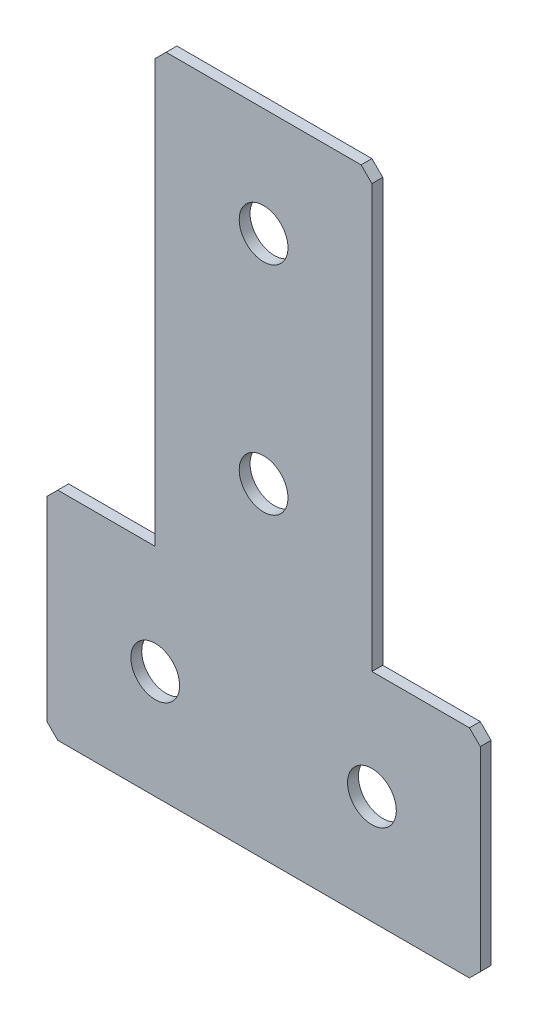
ISO-10303-21;
HEADER;
FILE_DESCRIPTION(('STEP AP214'),'2;1');
FILE_NAME('part.step','',(''),(''),'','','');
FILE_SCHEMA(('AUTOMOTIVE_DESIGN { 1 0 10303 214 1 1 1 1 }'));
ENDSEC;
DATA;
#1=APPLICATION_CONTEXT('core data for automotive mechanical design processes');
#2=APPLICATION_PROTOCOL_DEFINITION('international standard','automotive_design',2000,#1);
#3=PRODUCT_CONTEXT('',#1,'mechanical');
#4=PRODUCT('Part','Part','',(#3));
#5=PRODUCT_RELATED_PRODUCT_CATEGORY('part','',(#4));
#6=PRODUCT_DEFINITION_FORMATION('','',#4);
#7=PRODUCT_DEFINITION_CONTEXT('part definition',#1,'design');
#8=PRODUCT_DEFINITION('design','',#6,#7);
#9=PRODUCT_DEFINITION_SHAPE('','',#8);
#10=(LENGTH_UNIT() NAMED_UNIT(*) SI_UNIT(.MILLI.,.METRE.));
#11=(NAMED_UNIT(*) PLANE_ANGLE_UNIT() SI_UNIT($,.RADIAN.));
#12=(NAMED_UNIT(*) SI_UNIT($,.STERADIAN.) SOLID_ANGLE_UNIT());
#13=UNCERTAINTY_MEASURE_WITH_UNIT(LENGTH_MEASURE(1.E-05),#10,'distance_accuracy_value','');
#14=(GEOMETRIC_REPRESENTATION_CONTEXT(3) GLOBAL_UNCERTAINTY_ASSIGNED_CONTEXT((#13)) GLOBAL_UNIT_ASSIGNED_CONTEXT((#10,
#11,#12)) REPRESENTATION_CONTEXT('',''));
#15=CARTESIAN_POINT('',(0.,0.,0.));
#16=DIRECTION('',(0.,0.,1.));
#17=DIRECTION('',(1.,0.,0.));
#18=AXIS2_PLACEMENT_3D('',#15,#16,#17);
#19=CARTESIAN_POINT('',(-20.,-80.,-2.));
#20=DIRECTION('',(1.,0.,0.));
#21=DIRECTION('',(0.,1.,0.));
#22=AXIS2_PLACEMENT_3D('',#19,#20,#21);
#23=PLANE('',#22);
#24=DIRECTION('',(0.,1.,0.));
#25=VECTOR('',#24,1.);
#26=CARTESIAN_POINT('',(-20.,-80.,0.));
#27=LINE('',#26,#25);
#28=CARTESIAN_POINT('',(-20.,-80.,0.));
#29=VERTEX_POINT('',#28);
#30=CARTESIAN_POINT('',(-20.,-2.00000000000002,0.));
#31=VERTEX_POINT('',#30);
#32=EDGE_CURVE('E178',#29,#31,#27,.T.);
#33=ORIENTED_EDGE('',*,*,#32,.T.);
#34=DIRECTION('',(0.,0.,-1.));
#35=VECTOR('',#34,1.);
#36=CARTESIAN_POINT('',(-20.,-2.00000000000002,-2.));
#37=LINE('',#36,#35);
#38=CARTESIAN_POINT('',(-20.,-2.00000000000002,-2.));
#39=VERTEX_POINT('',#38);
#40=EDGE_CURVE('E240',#31,#39,#37,.T.);
#41=ORIENTED_EDGE('',*,*,#40,.T.);
#42=DIRECTION('',(0.,1.,0.));
#43=VECTOR('',#42,1.);
#44=CARTESIAN_POINT('',(-20.,-80.,-2.));
#45=LINE('',#44,#43);
#46=CARTESIAN_POINT('',(-20.,-80.,-2.));
#47=VERTEX_POINT('',#46);
#48=EDGE_CURVE('E198',#47,#39,#45,.T.);
#49=ORIENTED_EDGE('',*,*,#48,.F.);
#50=DIRECTION('',(0.,0.,1.));
#51=VECTOR('',#50,1.);
#52=CARTESIAN_POINT('',(-20.,-80.,-2.));
#53=LINE('',#52,#51);
#54=EDGE_CURVE('E163',#47,#29,#53,.T.);
#55=ORIENTED_EDGE('',*,*,#54,.T.);
#56=EDGE_LOOP('',(#33,#41,#49,#55));
#57=FACE_BOUND('',#56,.T.);
#58=ADVANCED_FACE('F37',(#57),#23,.F.);
#59=CARTESIAN_POINT('',(20.,0.,-2.));
#60=DIRECTION('',(0.,-1.,0.));
#61=DIRECTION('',(1.,0.,0.));
#62=AXIS2_PLACEMENT_3D('',#59,#60,#61);
#63=PLANE('',#62);
#64=DIRECTION('',(1.,0.,0.));
#65=VECTOR('',#64,1.);
#66=CARTESIAN_POINT('',(20.,0.,-2.));
#67=LINE('',#66,#65);
#68=CARTESIAN_POINT('',(-18.,0.,-2.));
#69=VERTEX_POINT('',#68);
#70=CARTESIAN_POINT('',(18.,0.,-2.));
#71=VERTEX_POINT('',#70);
#72=EDGE_CURVE('E152',#69,#71,#67,.T.);
#73=ORIENTED_EDGE('',*,*,#72,.F.);
#74=DIRECTION('',(0.,0.,1.));
#75=VECTOR('',#74,1.);
#76=CARTESIAN_POINT('',(-18.,0.,-2.));
#77=LINE('',#76,#75);
#78=CARTESIAN_POINT('',(-18.,0.,0.));
#79=VERTEX_POINT('',#78);
#80=EDGE_CURVE('E237',#69,#79,#77,.T.);
#81=ORIENTED_EDGE('',*,*,#80,.T.);
#82=DIRECTION('',(1.,0.,0.));
#83=VECTOR('',#82,1.);
#84=CARTESIAN_POINT('',(20.,0.,0.));
#85=LINE('',#84,#83);
#86=CARTESIAN_POINT('',(18.,0.,0.));
#87=VERTEX_POINT('',#86);
#88=EDGE_CURVE('E181',#79,#87,#85,.T.);
#89=ORIENTED_EDGE('',*,*,#88,.T.);
#90=DIRECTION('',(0.,0.,-1.));
#91=VECTOR('',#90,1.);
#92=CARTESIAN_POINT('',(18.,0.,-2.));
#93=LINE('',#92,#91);
#94=EDGE_CURVE('E235',#87,#71,#93,.T.);
#95=ORIENTED_EDGE('',*,*,#94,.T.);
#96=EDGE_LOOP('',(#73,#81,#89,#95));
#97=FACE_BOUND('',#96,.T.);
#98=ADVANCED_FACE('F288',(#97),#63,.F.);
#99=CARTESIAN_POINT('',(20.,-80.,-2.));
#100=DIRECTION('',(-1.,0.,0.));
#101=DIRECTION('',(0.,-1.,0.));
#102=AXIS2_PLACEMENT_3D('',#99,#100,#101);
#103=PLANE('',#102);
#104=DIRECTION('',(0.,-1.,0.));
#105=VECTOR('',#104,1.);
#106=CARTESIAN_POINT('',(20.,-80.,-2.));
#107=LINE('',#106,#105);
#108=CARTESIAN_POINT('',(20.,-2.00000000000002,-2.));
#109=VERTEX_POINT('',#108);
#110=CARTESIAN_POINT('',(20.,-80.,-2.));
#111=VERTEX_POINT('',#110);
#112=EDGE_CURVE('E139',#109,#111,#107,.T.);
#113=ORIENTED_EDGE('',*,*,#112,.F.);
#114=DIRECTION('',(0.,0.,1.));
#115=VECTOR('',#114,1.);
#116=CARTESIAN_POINT('',(20.,-2.00000000000002,-2.));
#117=LINE('',#116,#115);
#118=CARTESIAN_POINT('',(20.,-2.00000000000002,0.));
#119=VERTEX_POINT('',#118);
#120=EDGE_CURVE('E242',#109,#119,#117,.T.);
#121=ORIENTED_EDGE('',*,*,#120,.T.);
#122=DIRECTION('',(0.,-1.,0.));
#123=VECTOR('',#122,1.);
#124=CARTESIAN_POINT('',(20.,-80.,0.));
#125=LINE('',#124,#123);
#126=CARTESIAN_POINT('',(20.,-80.,0.));
#127=VERTEX_POINT('',#126);
#128=EDGE_CURVE('E158',#119,#127,#125,.T.);
#129=ORIENTED_EDGE('',*,*,#128,.T.);
#130=DIRECTION('',(0.,0.,1.));
#131=VECTOR('',#130,1.);
#132=CARTESIAN_POINT('',(20.,-80.,-2.));
#133=LINE('',#132,#131);
#134=EDGE_CURVE('E155',#111,#127,#133,.T.);
#135=ORIENTED_EDGE('',*,*,#134,.F.);
#136=EDGE_LOOP('',(#113,#121,#129,#135));
#137=FACE_BOUND('',#136,.T.);
#138=ADVANCED_FACE('F156',(#137),#103,.F.);
#139=CARTESIAN_POINT('',(40.,-80.,-2.));
#140=DIRECTION('',(0.,-1.,0.));
#141=DIRECTION('',(0.,0.,-1.));
#142=AXIS2_PLACEMENT_3D('',#139,#140,#141);
#143=PLANE('',#142);
#144=DIRECTION('',(1.,0.,0.));
#145=VECTOR('',#144,1.);
#146=CARTESIAN_POINT('',(40.,-80.,0.));
#147=LINE('',#146,#145);
#148=CARTESIAN_POINT('',(38.,-80.,0.));
#149=VERTEX_POINT('',#148);
#150=EDGE_CURVE('E186',#127,#149,#147,.T.);
#151=ORIENTED_EDGE('',*,*,#150,.T.);
#152=DIRECTION('',(0.,0.,-1.));
#153=VECTOR('',#152,1.);
#154=CARTESIAN_POINT('',(38.,-80.,-2.));
#155=LINE('',#154,#153);
#156=CARTESIAN_POINT('',(38.,-80.,-2.));
#157=VERTEX_POINT('',#156);
#158=EDGE_CURVE('E11',#149,#157,#155,.T.);
#159=ORIENTED_EDGE('',*,*,#158,.T.);
#160=DIRECTION('',(1.,0.,0.));
#161=VECTOR('',#160,1.);
#162=CARTESIAN_POINT('',(40.,-80.,-2.));
#163=LINE('',#162,#161);
#164=EDGE_CURVE('E144',#111,#157,#163,.T.);
#165=ORIENTED_EDGE('',*,*,#164,.F.);
#166=ORIENTED_EDGE('',*,*,#134,.T.);
#167=EDGE_LOOP('',(#151,#159,#165,#166));
#168=FACE_BOUND('',#167,.T.);
#169=ADVANCED_FACE('F165',(#168),#143,.F.);
#170=CARTESIAN_POINT('',(40.,-120.,-2.));
#171=DIRECTION('',(-1.,0.,0.));
#172=DIRECTION('',(0.,-1.,0.));
#173=AXIS2_PLACEMENT_3D('',#170,#171,#172);
#174=PLANE('',#173);
#175=DIRECTION('',(0.,-1.,0.));
#176=VECTOR('',#175,1.);
#177=CARTESIAN_POINT('',(40.,-120.,-2.));
#178=LINE('',#177,#176);
#179=CARTESIAN_POINT('',(40.,-82.,-2.));
#180=VERTEX_POINT('',#179);
#181=CARTESIAN_POINT('',(40.,-118.,-2.));
#182=VERTEX_POINT('',#181);
#183=EDGE_CURVE('E167',#180,#182,#178,.T.);
#184=ORIENTED_EDGE('',*,*,#183,.F.);
#185=DIRECTION('',(0.,0.,1.));
#186=VECTOR('',#185,1.);
#187=CARTESIAN_POINT('',(40.,-82.,-2.));
#188=LINE('',#187,#186);
#189=CARTESIAN_POINT('',(40.,-82.,0.));
#190=VERTEX_POINT('',#189);
#191=EDGE_CURVE('E45',#180,#190,#188,.T.);
#192=ORIENTED_EDGE('',*,*,#191,.T.);
#193=DIRECTION('',(0.,-1.,0.));
#194=VECTOR('',#193,1.);
#195=CARTESIAN_POINT('',(40.,-120.,0.));
#196=LINE('',#195,#194);
#197=CARTESIAN_POINT('',(40.,-118.,0.));
#198=VERTEX_POINT('',#197);
#199=EDGE_CURVE('E188',#190,#198,#196,.T.);
#200=ORIENTED_EDGE('',*,*,#199,.T.);
#201=DIRECTION('',(0.,0.,-1.));
#202=VECTOR('',#201,1.);
#203=CARTESIAN_POINT('',(40.,-118.,-2.));
#204=LINE('',#203,#202);
#205=EDGE_CURVE('E60',#198,#182,#204,.T.);
#206=ORIENTED_EDGE('',*,*,#205,.T.);
#207=EDGE_LOOP('',(#184,#192,#200,#206));
#208=FACE_BOUND('',#207,.T.);
#209=ADVANCED_FACE('F247',(#208),#174,.F.);
#210=CARTESIAN_POINT('',(-40.,-120.,-2.));
#211=DIRECTION('',(0.,1.,0.));
#212=DIRECTION('',(0.,0.,1.));
#213=AXIS2_PLACEMENT_3D('',#210,#211,#212);
#214=PLANE('',#213);
#215=DIRECTION('',(-1.,0.,0.));
#216=VECTOR('',#215,1.);
#217=CARTESIAN_POINT('',(-40.,-120.,0.));
#218=LINE('',#217,#216);
#219=CARTESIAN_POINT('',(38.,-120.,0.));
#220=VERTEX_POINT('',#219);
#221=CARTESIAN_POINT('',(-38.,-120.,0.));
#222=VERTEX_POINT('',#221);
#223=EDGE_CURVE('E190',#220,#222,#218,.T.);
#224=ORIENTED_EDGE('',*,*,#223,.T.);
#225=DIRECTION('',(0.,0.,-1.));
#226=VECTOR('',#225,1.);
#227=CARTESIAN_POINT('',(-38.,-120.,-2.));
#228=LINE('',#227,#226);
#229=CARTESIAN_POINT('',(-38.,-120.,-2.));
#230=VERTEX_POINT('',#229);
#231=EDGE_CURVE('E220',#222,#230,#228,.T.);
#232=ORIENTED_EDGE('',*,*,#231,.T.);
#233=DIRECTION('',(-1.,0.,0.));
#234=VECTOR('',#233,1.);
#235=CARTESIAN_POINT('',(-40.,-120.,-2.));
#236=LINE('',#235,#234);
#237=CARTESIAN_POINT('',(38.,-120.,-2.));
#238=VERTEX_POINT('',#237);
#239=EDGE_CURVE('E169',#238,#230,#236,.T.);
#240=ORIENTED_EDGE('',*,*,#239,.F.);
#241=DIRECTION('',(0.,0.,1.));
#242=VECTOR('',#241,1.);
#243=CARTESIAN_POINT('',(38.,-120.,-2.));
#244=LINE('',#243,#242);
#245=EDGE_CURVE('E217',#238,#220,#244,.T.);
#246=ORIENTED_EDGE('',*,*,#245,.T.);
#247=EDGE_LOOP('',(#224,#232,#240,#246));
#248=FACE_BOUND('',#247,.T.);
#249=ADVANCED_FACE('F258',(#248),#214,.F.);
#250=CARTESIAN_POINT('',(-40.,-120.,-2.));
#251=DIRECTION('',(1.,0.,0.));
#252=DIRECTION('',(0.,1.,0.));
#253=AXIS2_PLACEMENT_3D('',#250,#251,#252);
#254=PLANE('',#253);
#255=DIRECTION('',(0.,1.,0.));
#256=VECTOR('',#255,1.);
#257=CARTESIAN_POINT('',(-40.,-120.,-2.));
#258=LINE('',#257,#256);
#259=CARTESIAN_POINT('',(-40.,-118.,-2.));
#260=VERTEX_POINT('',#259);
#261=CARTESIAN_POINT('',(-40.,-82.,-2.));
#262=VERTEX_POINT('',#261);
#263=EDGE_CURVE('E174',#260,#262,#258,.T.);
#264=ORIENTED_EDGE('',*,*,#263,.F.);
#265=DIRECTION('',(0.,0.,1.));
#266=VECTOR('',#265,1.);
#267=CARTESIAN_POINT('',(-40.,-118.,-2.));
#268=LINE('',#267,#266);
#269=CARTESIAN_POINT('',(-40.,-118.,0.));
#270=VERTEX_POINT('',#269);
#271=EDGE_CURVE('E202',#260,#270,#268,.T.);
#272=ORIENTED_EDGE('',*,*,#271,.T.);
#273=DIRECTION('',(0.,1.,0.));
#274=VECTOR('',#273,1.);
#275=CARTESIAN_POINT('',(-40.,-120.,0.));
#276=LINE('',#275,#274);
#277=CARTESIAN_POINT('',(-40.,-82.,0.));
#278=VERTEX_POINT('',#277);
#279=EDGE_CURVE('E193',#270,#278,#276,.T.);
#280=ORIENTED_EDGE('',*,*,#279,.T.);
#281=DIRECTION('',(0.,0.,-1.));
#282=VECTOR('',#281,1.);
#283=CARTESIAN_POINT('',(-40.,-82.,-2.));
#284=LINE('',#283,#282);
#285=EDGE_CURVE('E162',#278,#262,#284,.T.);
#286=ORIENTED_EDGE('',*,*,#285,.T.);
#287=EDGE_LOOP('',(#264,#272,#280,#286));
#288=FACE_BOUND('',#287,.T.);
#289=ADVANCED_FACE('F266',(#288),#254,.F.);
#290=CARTESIAN_POINT('',(-40.,-80.,-2.));
#291=DIRECTION('',(0.,-1.,0.));
#292=DIRECTION('',(0.,0.,-1.));
#293=AXIS2_PLACEMENT_3D('',#290,#291,#292);
#294=PLANE('',#293);
#295=DIRECTION('',(1.,0.,0.));
#296=VECTOR('',#295,1.);
#297=CARTESIAN_POINT('',(-40.,-80.,-2.));
#298=LINE('',#297,#296);
#299=CARTESIAN_POINT('',(-38.,-80.,-2.));
#300=VERTEX_POINT('',#299);
#301=EDGE_CURVE('E176',#300,#47,#298,.T.);
#302=ORIENTED_EDGE('',*,*,#301,.F.);
#303=DIRECTION('',(0.,0.,1.));
#304=VECTOR('',#303,1.);
#305=CARTESIAN_POINT('',(-38.,-80.,-2.));
#306=LINE('',#305,#304);
#307=CARTESIAN_POINT('',(-38.,-80.,0.));
#308=VERTEX_POINT('',#307);
#309=EDGE_CURVE('E232',#300,#308,#306,.T.);
#310=ORIENTED_EDGE('',*,*,#309,.T.);
#311=DIRECTION('',(1.,0.,0.));
#312=VECTOR('',#311,1.);
#313=CARTESIAN_POINT('',(-40.,-80.,0.));
#314=LINE('',#313,#312);
#315=EDGE_CURVE('E196',#308,#29,#314,.T.);
#316=ORIENTED_EDGE('',*,*,#315,.T.);
#317=ORIENTED_EDGE('',*,*,#54,.F.);
#318=EDGE_LOOP('',(#302,#310,#316,#317));
#319=FACE_BOUND('',#318,.T.);
#320=ADVANCED_FACE('F274',(#319),#294,.F.);
#321=CARTESIAN_POINT('',(0.,0.,-2.));
#322=DIRECTION('',(0.,0.,1.));
#323=DIRECTION('',(1.,0.,0.));
#324=AXIS2_PLACEMENT_3D('',#321,#322,#323);
#325=PLANE('',#324);
#326=CARTESIAN_POINT('',(0.,-60.,-2.));
#327=DIRECTION('',(0.,0.,-1.));
#328=DIRECTION('',(0.,1.,0.));
#329=AXIS2_PLACEMENT_3D('',#326,#327,#328);
#330=CIRCLE('',#329,4.5);
#331=CARTESIAN_POINT('',(0.,-55.5,-2.));
#332=VERTEX_POINT('',#331);
#333=EDGE_CURVE('E313',#332,#332,#330,.T.);
#334=ORIENTED_EDGE('',*,*,#333,.F.);
#335=EDGE_LOOP('',(#334));
#336=FACE_BOUND('',#335,.T.);
#337=CARTESIAN_POINT('',(0.,-20.,-2.));
#338=DIRECTION('',(0.,0.,-1.));
#339=DIRECTION('',(0.,1.,0.));
#340=AXIS2_PLACEMENT_3D('',#337,#338,#339);
#341=CIRCLE('',#340,4.5);
#342=CARTESIAN_POINT('',(0.,-15.5,-2.));
#343=VERTEX_POINT('',#342);
#344=EDGE_CURVE('E307',#343,#343,#341,.T.);
#345=ORIENTED_EDGE('',*,*,#344,.F.);
#346=EDGE_LOOP('',(#345));
#347=FACE_BOUND('',#346,.T.);
#348=CARTESIAN_POINT('',(-20.,-100.,-2.00000000000001));
#349=DIRECTION('',(0.,0.,-1.));
#350=DIRECTION('',(0.,1.,0.));
#351=AXIS2_PLACEMENT_3D('',#348,#349,#350);
#352=CIRCLE('',#351,4.5);
#353=CARTESIAN_POINT('',(-20.,-95.5,-2.00000000000001));
#354=VERTEX_POINT('',#353);
#355=EDGE_CURVE('E301',#354,#354,#352,.T.);
#356=ORIENTED_EDGE('',*,*,#355,.F.);
#357=EDGE_LOOP('',(#356));
#358=FACE_BOUND('',#357,.T.);
#359=CARTESIAN_POINT('',(20.,-100.,-2.00000000000001));
#360=DIRECTION('',(0.,0.,-1.));
#361=DIRECTION('',(0.,1.,0.));
#362=AXIS2_PLACEMENT_3D('',#359,#360,#361);
#363=CIRCLE('',#362,4.5);
#364=CARTESIAN_POINT('',(20.,-95.5,-2.00000000000001));
#365=VERTEX_POINT('',#364);
#366=EDGE_CURVE('E295',#365,#365,#363,.T.);
#367=ORIENTED_EDGE('',*,*,#366,.F.);
#368=EDGE_LOOP('',(#367));
#369=FACE_BOUND('',#368,.T.);
#370=ORIENTED_EDGE('',*,*,#239,.T.);
#371=DIRECTION('',(0.707106781186548,-0.707106781186548,0.));
#372=VECTOR('',#371,1.);
#373=CARTESIAN_POINT('',(-40.,-118.,-2.));
#374=LINE('',#373,#372);
#375=EDGE_CURVE('E230',#230,#260,#374,.F.);
#376=ORIENTED_EDGE('',*,*,#375,.T.);
#377=ORIENTED_EDGE('',*,*,#263,.T.);
#378=DIRECTION('',(-0.707106781186545,-0.70710678118655,0.));
#379=VECTOR('',#378,1.);
#380=CARTESIAN_POINT('',(-38.,-80.,-2.));
#381=LINE('',#380,#379);
#382=EDGE_CURVE('E52',#262,#300,#381,.F.);
#383=ORIENTED_EDGE('',*,*,#382,.T.);
#384=ORIENTED_EDGE('',*,*,#301,.T.);
#385=ORIENTED_EDGE('',*,*,#48,.T.);
#386=DIRECTION('',(-0.707106781186548,-0.707106781186547,0.));
#387=VECTOR('',#386,1.);
#388=CARTESIAN_POINT('',(-18.,0.,-2.));
#389=LINE('',#388,#387);
#390=EDGE_CURVE('E227',#39,#69,#389,.F.);
#391=ORIENTED_EDGE('',*,*,#390,.T.);
#392=ORIENTED_EDGE('',*,*,#72,.T.);
#393=DIRECTION('',(-0.707106781186547,0.707106781186548,0.));
#394=VECTOR('',#393,1.);
#395=CARTESIAN_POINT('',(20.,-2.00000000000002,-2.));
#396=LINE('',#395,#394);
#397=EDGE_CURVE('E148',#71,#109,#396,.F.);
#398=ORIENTED_EDGE('',*,*,#397,.T.);
#399=ORIENTED_EDGE('',*,*,#112,.T.);
#400=ORIENTED_EDGE('',*,*,#164,.T.);
#401=DIRECTION('',(-0.70710678118655,0.707106781186545,0.));
#402=VECTOR('',#401,1.);
#403=CARTESIAN_POINT('',(40.,-82.,-2.));
#404=LINE('',#403,#402);
#405=EDGE_CURVE('E224',#157,#180,#404,.F.);
#406=ORIENTED_EDGE('',*,*,#405,.T.);
#407=ORIENTED_EDGE('',*,*,#183,.T.);
#408=DIRECTION('',(0.707106781186549,0.707106781186546,0.));
#409=VECTOR('',#408,1.);
#410=CARTESIAN_POINT('',(38.,-120.,-2.));
#411=LINE('',#410,#409);
#412=EDGE_CURVE('E222',#182,#238,#411,.F.);
#413=ORIENTED_EDGE('',*,*,#412,.T.);
#414=EDGE_LOOP('',(#370,#376,#377,#383,#384,#385,#391,#392,#398,#399,#400,#406,#407,#413));
#415=FACE_BOUND('',#414,.T.);
#416=ADVANCED_FACE('F142',(#336,#347,#358,#369,#415),#325,.F.);
#417=CARTESIAN_POINT('',(0.,0.,0.));
#418=DIRECTION('',(0.,0.,1.));
#419=DIRECTION('',(1.,0.,0.));
#420=AXIS2_PLACEMENT_3D('',#417,#418,#419);
#421=PLANE('',#420);
#422=CARTESIAN_POINT('',(0.,-60.,0.));
#423=DIRECTION('',(0.,0.,-1.));
#424=DIRECTION('',(0.,1.,0.));
#425=AXIS2_PLACEMENT_3D('',#422,#423,#424);
#426=CIRCLE('',#425,4.5);
#427=CARTESIAN_POINT('',(0.,-55.5,0.));
#428=VERTEX_POINT('',#427);
#429=EDGE_CURVE('E310',#428,#428,#426,.T.);
#430=ORIENTED_EDGE('',*,*,#429,.T.);
#431=EDGE_LOOP('',(#430));
#432=FACE_BOUND('',#431,.T.);
#433=CARTESIAN_POINT('',(0.,-20.,0.));
#434=DIRECTION('',(0.,0.,-1.));
#435=DIRECTION('',(0.,1.,0.));
#436=AXIS2_PLACEMENT_3D('',#433,#434,#435);
#437=CIRCLE('',#436,4.5);
#438=CARTESIAN_POINT('',(0.,-15.5,0.));
#439=VERTEX_POINT('',#438);
#440=EDGE_CURVE('E304',#439,#439,#437,.T.);
#441=ORIENTED_EDGE('',*,*,#440,.T.);
#442=EDGE_LOOP('',(#441));
#443=FACE_BOUND('',#442,.T.);
#444=CARTESIAN_POINT('',(-20.,-100.,0.));
#445=DIRECTION('',(0.,0.,-1.));
#446=DIRECTION('',(0.,1.,0.));
#447=AXIS2_PLACEMENT_3D('',#444,#445,#446);
#448=CIRCLE('',#447,4.5);
#449=CARTESIAN_POINT('',(-20.,-95.5,0.));
#450=VERTEX_POINT('',#449);
#451=EDGE_CURVE('E298',#450,#450,#448,.T.);
#452=ORIENTED_EDGE('',*,*,#451,.T.);
#453=EDGE_LOOP('',(#452));
#454=FACE_BOUND('',#453,.T.);
#455=CARTESIAN_POINT('',(20.,-100.,0.));
#456=DIRECTION('',(0.,0.,-1.));
#457=DIRECTION('',(0.,1.,0.));
#458=AXIS2_PLACEMENT_3D('',#455,#456,#457);
#459=CIRCLE('',#458,4.5);
#460=CARTESIAN_POINT('',(20.,-95.5,0.));
#461=VERTEX_POINT('',#460);
#462=EDGE_CURVE('E182',#461,#461,#459,.T.);
#463=ORIENTED_EDGE('',*,*,#462,.T.);
#464=EDGE_LOOP('',(#463));
#465=FACE_BOUND('',#464,.T.);
#466=ORIENTED_EDGE('',*,*,#279,.F.);
#467=DIRECTION('',(-0.707106781186548,0.707106781186548,0.));
#468=VECTOR('',#467,1.);
#469=CARTESIAN_POINT('',(-79.,-79.,0.));
#470=LINE('',#469,#468);
#471=EDGE_CURVE('E215',#270,#222,#470,.F.);
#472=ORIENTED_EDGE('',*,*,#471,.T.);
#473=ORIENTED_EDGE('',*,*,#223,.F.);
#474=DIRECTION('',(-0.707106781186549,-0.707106781186546,0.));
#475=VECTOR('',#474,1.);
#476=CARTESIAN_POINT('',(78.9999999999999,-79.0000000000002,0.));
#477=LINE('',#476,#475);
#478=EDGE_CURVE('E205',#220,#198,#477,.F.);
#479=ORIENTED_EDGE('',*,*,#478,.T.);
#480=ORIENTED_EDGE('',*,*,#199,.F.);
#481=DIRECTION('',(0.70710678118655,-0.707106781186545,0.));
#482=VECTOR('',#481,1.);
#483=CARTESIAN_POINT('',(-21.0000000000001,-21.0000000000003,0.));
#484=LINE('',#483,#482);
#485=EDGE_CURVE('E207',#190,#149,#484,.F.);
#486=ORIENTED_EDGE('',*,*,#485,.T.);
#487=ORIENTED_EDGE('',*,*,#150,.F.);
#488=ORIENTED_EDGE('',*,*,#128,.F.);
#489=DIRECTION('',(0.707106781186547,-0.707106781186548,0.));
#490=VECTOR('',#489,1.);
#491=CARTESIAN_POINT('',(9.00000000000001,8.99999999999999,0.));
#492=LINE('',#491,#490);
#493=EDGE_CURVE('E209',#119,#87,#492,.F.);
#494=ORIENTED_EDGE('',*,*,#493,.T.);
#495=ORIENTED_EDGE('',*,*,#88,.F.);
#496=DIRECTION('',(0.707106781186548,0.707106781186547,0.));
#497=VECTOR('',#496,1.);
#498=CARTESIAN_POINT('',(-8.99999999999998,8.99999999999999,0.));
#499=LINE('',#498,#497);
#500=EDGE_CURVE('E211',#79,#31,#499,.F.);
#501=ORIENTED_EDGE('',*,*,#500,.T.);
#502=ORIENTED_EDGE('',*,*,#32,.F.);
#503=ORIENTED_EDGE('',*,*,#315,.F.);
#504=DIRECTION('',(0.707106781186545,0.70710678118655,0.));
#505=VECTOR('',#504,1.);
#506=CARTESIAN_POINT('',(20.9999999999999,-20.9999999999997,0.));
#507=LINE('',#506,#505);
#508=EDGE_CURVE('E213',#308,#278,#507,.F.);
#509=ORIENTED_EDGE('',*,*,#508,.T.);
#510=EDGE_LOOP('',(#466,#472,#473,#479,#480,#486,#487,#488,#494,#495,#501,#502,#503,#509));
#511=FACE_BOUND('',#510,.T.);
#512=ADVANCED_FACE('F251',(#432,#443,#454,#465,#511),#421,.T.);
#513=CARTESIAN_POINT('',(20.,-100.,-2.00000000000001));
#514=DIRECTION('',(0.,0.,-1.));
#515=DIRECTION('',(0.,1.,0.));
#516=AXIS2_PLACEMENT_3D('',#513,#514,#515);
#517=CYLINDRICAL_SURFACE('',#516,4.5);
#518=ORIENTED_EDGE('',*,*,#462,.F.);
#519=EDGE_LOOP('',(#518));
#520=FACE_BOUND('',#519,.T.);
#521=ORIENTED_EDGE('',*,*,#366,.T.);
#522=EDGE_LOOP('',(#521));
#523=FACE_BOUND('',#522,.T.);
#524=ADVANCED_FACE('F328',(#520,#523),#517,.F.);
#525=CARTESIAN_POINT('',(-20.,-100.,-2.00000000000001));
#526=DIRECTION('',(0.,0.,-1.));
#527=DIRECTION('',(0.,1.,0.));
#528=AXIS2_PLACEMENT_3D('',#525,#526,#527);
#529=CYLINDRICAL_SURFACE('',#528,4.5);
#530=ORIENTED_EDGE('',*,*,#451,.F.);
#531=EDGE_LOOP('',(#530));
#532=FACE_BOUND('',#531,.T.);
#533=ORIENTED_EDGE('',*,*,#355,.T.);
#534=EDGE_LOOP('',(#533));
#535=FACE_BOUND('',#534,.T.);
#536=ADVANCED_FACE('F330',(#532,#535),#529,.F.);
#537=CARTESIAN_POINT('',(0.,-20.,-2.));
#538=DIRECTION('',(0.,0.,-1.));
#539=DIRECTION('',(0.,1.,0.));
#540=AXIS2_PLACEMENT_3D('',#537,#538,#539);
#541=CYLINDRICAL_SURFACE('',#540,4.5);
#542=ORIENTED_EDGE('',*,*,#440,.F.);
#543=EDGE_LOOP('',(#542));
#544=FACE_BOUND('',#543,.T.);
#545=ORIENTED_EDGE('',*,*,#344,.T.);
#546=EDGE_LOOP('',(#545));
#547=FACE_BOUND('',#546,.T.);
#548=ADVANCED_FACE('F337',(#544,#547),#541,.F.);
#549=CARTESIAN_POINT('',(0.,-60.,-2.));
#550=DIRECTION('',(0.,0.,-1.));
#551=DIRECTION('',(0.,1.,0.));
#552=AXIS2_PLACEMENT_3D('',#549,#550,#551);
#553=CYLINDRICAL_SURFACE('',#552,4.5);
#554=ORIENTED_EDGE('',*,*,#429,.F.);
#555=EDGE_LOOP('',(#554));
#556=FACE_BOUND('',#555,.T.);
#557=ORIENTED_EDGE('',*,*,#333,.T.);
#558=EDGE_LOOP('',(#557));
#559=FACE_BOUND('',#558,.T.);
#560=ADVANCED_FACE('F317',(#556,#559),#553,.F.);
#561=CARTESIAN_POINT('',(-40.,-118.,-2.));
#562=DIRECTION('',(0.707106781186547,0.707106781186547,0.));
#563=DIRECTION('',(0.,0.,1.));
#564=AXIS2_PLACEMENT_3D('',#561,#562,#563);
#565=PLANE('',#564);
#566=ORIENTED_EDGE('',*,*,#375,.F.);
#567=ORIENTED_EDGE('',*,*,#231,.F.);
#568=ORIENTED_EDGE('',*,*,#471,.F.);
#569=ORIENTED_EDGE('',*,*,#271,.F.);
#570=EDGE_LOOP('',(#566,#567,#568,#569));
#571=FACE_BOUND('',#570,.T.);
#572=ADVANCED_FACE('F264',(#571),#565,.F.);
#573=CARTESIAN_POINT('',(-38.,-80.,-2.));
#574=DIRECTION('',(0.70710678118655,-0.707106781186545,0.));
#575=DIRECTION('',(0.,0.,1.));
#576=AXIS2_PLACEMENT_3D('',#573,#574,#575);
#577=PLANE('',#576);
#578=ORIENTED_EDGE('',*,*,#382,.F.);
#579=ORIENTED_EDGE('',*,*,#285,.F.);
#580=ORIENTED_EDGE('',*,*,#508,.F.);
#581=ORIENTED_EDGE('',*,*,#309,.F.);
#582=EDGE_LOOP('',(#578,#579,#580,#581));
#583=FACE_BOUND('',#582,.T.);
#584=ADVANCED_FACE('F272',(#583),#577,.F.);
#585=CARTESIAN_POINT('',(-18.,0.,-2.));
#586=DIRECTION('',(0.707106781186547,-0.707106781186548,0.));
#587=DIRECTION('',(0.,0.,1.));
#588=AXIS2_PLACEMENT_3D('',#585,#586,#587);
#589=PLANE('',#588);
#590=ORIENTED_EDGE('',*,*,#390,.F.);
#591=ORIENTED_EDGE('',*,*,#40,.F.);
#592=ORIENTED_EDGE('',*,*,#500,.F.);
#593=ORIENTED_EDGE('',*,*,#80,.F.);
#594=EDGE_LOOP('',(#590,#591,#592,#593));
#595=FACE_BOUND('',#594,.T.);
#596=ADVANCED_FACE('F285',(#595),#589,.F.);
#597=CARTESIAN_POINT('',(20.,-2.00000000000002,-2.));
#598=DIRECTION('',(-0.707106781186548,-0.707106781186547,0.));
#599=DIRECTION('',(0.,0.,1.));
#600=AXIS2_PLACEMENT_3D('',#597,#598,#599);
#601=PLANE('',#600);
#602=ORIENTED_EDGE('',*,*,#397,.F.);
#603=ORIENTED_EDGE('',*,*,#94,.F.);
#604=ORIENTED_EDGE('',*,*,#493,.F.);
#605=ORIENTED_EDGE('',*,*,#120,.F.);
#606=EDGE_LOOP('',(#602,#603,#604,#605));
#607=FACE_BOUND('',#606,.T.);
#608=ADVANCED_FACE('F291',(#607),#601,.F.);
#609=CARTESIAN_POINT('',(40.,-82.,-2.));
#610=DIRECTION('',(-0.707106781186545,-0.70710678118655,0.));
#611=DIRECTION('',(0.,0.,1.));
#612=AXIS2_PLACEMENT_3D('',#609,#610,#611);
#613=PLANE('',#612);
#614=ORIENTED_EDGE('',*,*,#405,.F.);
#615=ORIENTED_EDGE('',*,*,#158,.F.);
#616=ORIENTED_EDGE('',*,*,#485,.F.);
#617=ORIENTED_EDGE('',*,*,#191,.F.);
#618=EDGE_LOOP('',(#614,#615,#616,#617));
#619=FACE_BOUND('',#618,.T.);
#620=ADVANCED_FACE('F358',(#619),#613,.F.);
#621=CARTESIAN_POINT('',(38.,-120.,-2.));
#622=DIRECTION('',(-0.707106781186546,0.707106781186549,0.));
#623=DIRECTION('',(0.,0.,1.));
#624=AXIS2_PLACEMENT_3D('',#621,#622,#623);
#625=PLANE('',#624);
#626=ORIENTED_EDGE('',*,*,#412,.F.);
#627=ORIENTED_EDGE('',*,*,#205,.F.);
#628=ORIENTED_EDGE('',*,*,#478,.F.);
#629=ORIENTED_EDGE('',*,*,#245,.F.);
#630=EDGE_LOOP('',(#626,#627,#628,#629));
#631=FACE_BOUND('',#630,.T.);
#632=ADVANCED_FACE('F39',(#631),#625,.F.);
#633=CLOSED_SHELL('',(#58,#98,#138,#169,#209,#249,#289,#320,#416,#512,#524,#536,#548,#560,#572,
#584,#596,#608,#620,#632));
#634=MANIFOLD_SOLID_BREP('B2',#633);
#635=ADVANCED_BREP_SHAPE_REPRESENTATION('',(#18,#634),#14);
#636=SHAPE_DEFINITION_REPRESENTATION(#9,#635);
ENDSEC;
END-ISO-10303-21;
